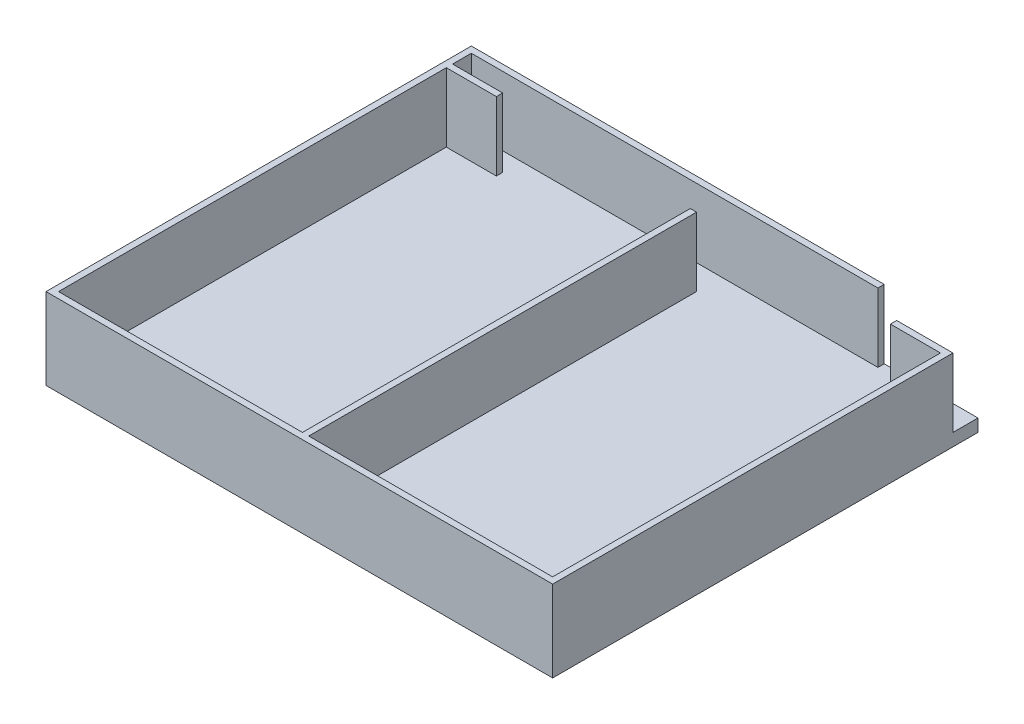
ISO-10303-21;
HEADER;
FILE_DESCRIPTION(('STEP AP214'),'2;1');
FILE_NAME('part.step','',(''),(''),'','','');
FILE_SCHEMA(('AUTOMOTIVE_DESIGN { 1 0 10303 214 1 1 1 1 }'));
ENDSEC;
DATA;
#1=APPLICATION_CONTEXT('core data for automotive mechanical design processes');
#2=APPLICATION_PROTOCOL_DEFINITION('international standard','automotive_design',2000,#1);
#3=PRODUCT_CONTEXT('',#1,'mechanical');
#4=PRODUCT('Part','Part','',(#3));
#5=PRODUCT_RELATED_PRODUCT_CATEGORY('part','',(#4));
#6=PRODUCT_DEFINITION_FORMATION('','',#4);
#7=PRODUCT_DEFINITION_CONTEXT('part definition',#1,'design');
#8=PRODUCT_DEFINITION('design','',#6,#7);
#9=PRODUCT_DEFINITION_SHAPE('','',#8);
#10=(LENGTH_UNIT() NAMED_UNIT(*) SI_UNIT(.MILLI.,.METRE.));
#11=(NAMED_UNIT(*) PLANE_ANGLE_UNIT() SI_UNIT($,.RADIAN.));
#12=(NAMED_UNIT(*) SI_UNIT($,.STERADIAN.) SOLID_ANGLE_UNIT());
#13=UNCERTAINTY_MEASURE_WITH_UNIT(LENGTH_MEASURE(1.E-05),#10,'distance_accuracy_value','');
#14=(GEOMETRIC_REPRESENTATION_CONTEXT(3) GLOBAL_UNCERTAINTY_ASSIGNED_CONTEXT((#13)) GLOBAL_UNIT_ASSIGNED_CONTEXT((#10,
#11,#12)) REPRESENTATION_CONTEXT('',''));
#15=CARTESIAN_POINT('',(0.,0.,0.));
#16=DIRECTION('',(0.,0.,1.));
#17=DIRECTION('',(1.,0.,0.));
#18=AXIS2_PLACEMENT_3D('',#15,#16,#17);
#19=CARTESIAN_POINT('',(0.,0.,0.));
#20=DIRECTION('',(0.,1.,0.));
#21=DIRECTION('',(0.,0.,1.));
#22=AXIS2_PLACEMENT_3D('',#19,#20,#21);
#23=PLANE('',#22);
#24=DIRECTION('',(0.,0.,-1.));
#25=VECTOR('',#24,1.);
#26=CARTESIAN_POINT('',(31.5,0.,0.));
#27=LINE('',#26,#25);
#28=CARTESIAN_POINT('',(31.5,0.,-29.));
#29=VERTEX_POINT('',#28);
#30=CARTESIAN_POINT('',(31.5,0.,-30.));
#31=VERTEX_POINT('',#30);
#32=EDGE_CURVE('E209',#29,#31,#27,.T.);
#33=ORIENTED_EDGE('',*,*,#32,.T.);
#34=DIRECTION('',(1.,0.,0.));
#35=VECTOR('',#34,1.);
#36=CARTESIAN_POINT('',(0.,0.,-30.));
#37=LINE('',#36,#35);
#38=CARTESIAN_POINT('',(40.5,0.,-30.));
#39=VERTEX_POINT('',#38);
#40=EDGE_CURVE('E65',#31,#39,#37,.T.);
#41=ORIENTED_EDGE('',*,*,#40,.T.);
#42=DIRECTION('',(0.,0.,-1.));
#43=VECTOR('',#42,1.);
#44=CARTESIAN_POINT('',(40.5,0.,0.));
#45=LINE('',#44,#43);
#46=CARTESIAN_POINT('',(40.5,0.,-34.));
#47=VERTEX_POINT('',#46);
#48=EDGE_CURVE('E184',#39,#47,#45,.T.);
#49=ORIENTED_EDGE('',*,*,#48,.T.);
#50=DIRECTION('',(1.,0.,0.));
#51=VECTOR('',#50,1.);
#52=CARTESIAN_POINT('',(0.,0.,-34.));
#53=LINE('',#52,#51);
#54=CARTESIAN_POINT('',(25.5,0.,-34.));
#55=VERTEX_POINT('',#54);
#56=EDGE_CURVE('E86',#55,#47,#53,.T.);
#57=ORIENTED_EDGE('',*,*,#56,.F.);
#58=DIRECTION('',(0.,0.,-1.));
#59=VECTOR('',#58,1.);
#60=CARTESIAN_POINT('',(25.5,0.,0.));
#61=LINE('',#60,#59);
#62=CARTESIAN_POINT('',(25.5,0.,-33.));
#63=VERTEX_POINT('',#62);
#64=EDGE_CURVE('E259',#63,#55,#61,.T.);
#65=ORIENTED_EDGE('',*,*,#64,.F.);
#66=DIRECTION('',(1.,0.,0.));
#67=VECTOR('',#66,1.);
#68=CARTESIAN_POINT('',(0.,0.,-33.));
#69=LINE('',#68,#67);
#70=CARTESIAN_POINT('',(-39.5,0.,-33.));
#71=VERTEX_POINT('',#70);
#72=EDGE_CURVE('E256',#71,#63,#69,.T.);
#73=ORIENTED_EDGE('',*,*,#72,.F.);
#74=DIRECTION('',(0.,0.,-1.));
#75=VECTOR('',#74,1.);
#76=CARTESIAN_POINT('',(-39.5000000000003,0.,-3.6544841227245E-13));
#77=LINE('',#76,#75);
#78=CARTESIAN_POINT('',(-39.5,0.,-30.));
#79=VERTEX_POINT('',#78);
#80=EDGE_CURVE('E253',#79,#71,#77,.T.);
#81=ORIENTED_EDGE('',*,*,#80,.F.);
#82=DIRECTION('',(-1.,0.,0.));
#83=VECTOR('',#82,1.);
#84=CARTESIAN_POINT('',(0.,0.,-30.));
#85=LINE('',#84,#83);
#86=CARTESIAN_POINT('',(-31.5,0.,-30.));
#87=VERTEX_POINT('',#86);
#88=EDGE_CURVE('E250',#87,#79,#85,.T.);
#89=ORIENTED_EDGE('',*,*,#88,.F.);
#90=DIRECTION('',(0.,0.,-1.));
#91=VECTOR('',#90,1.);
#92=CARTESIAN_POINT('',(-31.5,0.,0.));
#93=LINE('',#92,#91);
#94=CARTESIAN_POINT('',(-31.5,0.,-29.));
#95=VERTEX_POINT('',#94);
#96=EDGE_CURVE('E247',#95,#87,#93,.T.);
#97=ORIENTED_EDGE('',*,*,#96,.F.);
#98=DIRECTION('',(1.,0.,0.));
#99=VECTOR('',#98,1.);
#100=CARTESIAN_POINT('',(0.,0.,-29.));
#101=LINE('',#100,#99);
#102=CARTESIAN_POINT('',(-39.5,0.,-29.));
#103=VERTEX_POINT('',#102);
#104=EDGE_CURVE('E244',#103,#95,#101,.T.);
#105=ORIENTED_EDGE('',*,*,#104,.F.);
#106=DIRECTION('',(0.,0.,1.));
#107=VECTOR('',#106,1.);
#108=CARTESIAN_POINT('',(-39.5,0.,0.));
#109=LINE('',#108,#107);
#110=CARTESIAN_POINT('',(-39.5,0.,33.));
#111=VERTEX_POINT('',#110);
#112=EDGE_CURVE('E240',#103,#111,#109,.T.);
#113=ORIENTED_EDGE('',*,*,#112,.T.);
#114=DIRECTION('',(1.,0.,0.));
#115=VECTOR('',#114,1.);
#116=CARTESIAN_POINT('',(0.,0.,33.));
#117=LINE('',#116,#115);
#118=CARTESIAN_POINT('',(-0.500000000000008,0.,33.));
#119=VERTEX_POINT('',#118);
#120=EDGE_CURVE('E236',#111,#119,#117,.T.);
#121=ORIENTED_EDGE('',*,*,#120,.T.);
#122=DIRECTION('',(0.,0.,1.));
#123=VECTOR('',#122,1.);
#124=CARTESIAN_POINT('',(-0.500000000000004,0.,0.));
#125=LINE('',#124,#123);
#126=CARTESIAN_POINT('',(-0.5,0.,-29.));
#127=VERTEX_POINT('',#126);
#128=EDGE_CURVE('E232',#127,#119,#125,.T.);
#129=ORIENTED_EDGE('',*,*,#128,.F.);
#130=DIRECTION('',(1.,0.,0.));
#131=VECTOR('',#130,1.);
#132=CARTESIAN_POINT('',(0.,0.,-29.));
#133=LINE('',#132,#131);
#134=CARTESIAN_POINT('',(0.5,0.,-29.));
#135=VERTEX_POINT('',#134);
#136=EDGE_CURVE('E228',#127,#135,#133,.T.);
#137=ORIENTED_EDGE('',*,*,#136,.T.);
#138=DIRECTION('',(0.,0.,1.));
#139=VECTOR('',#138,1.);
#140=CARTESIAN_POINT('',(0.500000000000004,0.,0.));
#141=LINE('',#140,#139);
#142=CARTESIAN_POINT('',(0.500000000000008,0.,33.));
#143=VERTEX_POINT('',#142);
#144=EDGE_CURVE('E224',#135,#143,#141,.T.);
#145=ORIENTED_EDGE('',*,*,#144,.T.);
#146=DIRECTION('',(1.,0.,0.));
#147=VECTOR('',#146,1.);
#148=CARTESIAN_POINT('',(0.,0.,33.));
#149=LINE('',#148,#147);
#150=CARTESIAN_POINT('',(39.5,0.,33.));
#151=VERTEX_POINT('',#150);
#152=EDGE_CURVE('E220',#143,#151,#149,.T.);
#153=ORIENTED_EDGE('',*,*,#152,.T.);
#154=DIRECTION('',(0.,0.,1.));
#155=VECTOR('',#154,1.);
#156=CARTESIAN_POINT('',(39.5,0.,0.));
#157=LINE('',#156,#155);
#158=CARTESIAN_POINT('',(39.5,0.,-29.));
#159=VERTEX_POINT('',#158);
#160=EDGE_CURVE('E216',#159,#151,#157,.T.);
#161=ORIENTED_EDGE('',*,*,#160,.F.);
#162=DIRECTION('',(1.,0.,0.));
#163=VECTOR('',#162,1.);
#164=CARTESIAN_POINT('',(0.,0.,-29.));
#165=LINE('',#164,#163);
#166=EDGE_CURVE('E213',#29,#159,#165,.T.);
#167=ORIENTED_EDGE('',*,*,#166,.F.);
#168=EDGE_LOOP('',(#33,#41,#49,#57,#65,#73,#81,#89,#97,#105,#113,#121,#129,#137,#145,#153,#161,#167));
#169=FACE_BOUND('',#168,.T.);
#170=ADVANCED_FACE('F47',(#169),#23,.T.);
#171=CARTESIAN_POINT('',(40.5,-2.,0.));
#172=DIRECTION('',(1.,0.,0.));
#173=DIRECTION('',(0.,0.,-1.));
#174=AXIS2_PLACEMENT_3D('',#171,#172,#173);
#175=PLANE('',#174);
#176=ORIENTED_EDGE('',*,*,#48,.F.);
#177=DIRECTION('',(0.,-1.,0.));
#178=VECTOR('',#177,1.);
#179=CARTESIAN_POINT('',(40.5,11.,-30.));
#180=LINE('',#179,#178);
#181=CARTESIAN_POINT('',(40.5,11.,-30.));
#182=VERTEX_POINT('',#181);
#183=EDGE_CURVE('E203',#182,#39,#180,.T.);
#184=ORIENTED_EDGE('',*,*,#183,.F.);
#185=DIRECTION('',(0.,0.,-1.));
#186=VECTOR('',#185,1.);
#187=CARTESIAN_POINT('',(40.5,11.,0.));
#188=LINE('',#187,#186);
#189=CARTESIAN_POINT('',(40.5,11.,34.));
#190=VERTEX_POINT('',#189);
#191=EDGE_CURVE('E96',#190,#182,#188,.T.);
#192=ORIENTED_EDGE('',*,*,#191,.F.);
#193=DIRECTION('',(0.,1.,0.));
#194=VECTOR('',#193,1.);
#195=CARTESIAN_POINT('',(40.5,-2.,34.));
#196=LINE('',#195,#194);
#197=CARTESIAN_POINT('',(40.5,-2.,34.));
#198=VERTEX_POINT('',#197);
#199=EDGE_CURVE('E11',#198,#190,#196,.T.);
#200=ORIENTED_EDGE('',*,*,#199,.F.);
#201=DIRECTION('',(0.,0.,-1.));
#202=VECTOR('',#201,1.);
#203=CARTESIAN_POINT('',(40.5,-2.,0.));
#204=LINE('',#203,#202);
#205=CARTESIAN_POINT('',(40.5,-2.,-34.));
#206=VERTEX_POINT('',#205);
#207=EDGE_CURVE('E176',#198,#206,#204,.T.);
#208=ORIENTED_EDGE('',*,*,#207,.T.);
#209=DIRECTION('',(0.,1.,0.));
#210=VECTOR('',#209,1.);
#211=CARTESIAN_POINT('',(40.5,-2.,-34.));
#212=LINE('',#211,#210);
#213=EDGE_CURVE('E51',#206,#47,#212,.T.);
#214=ORIENTED_EDGE('',*,*,#213,.T.);
#215=EDGE_LOOP('',(#176,#184,#192,#200,#208,#214));
#216=FACE_BOUND('',#215,.T.);
#217=ADVANCED_FACE('F49',(#216),#175,.T.);
#218=CARTESIAN_POINT('',(0.,-2.,34.));
#219=DIRECTION('',(0.,0.,-1.));
#220=DIRECTION('',(-1.,0.,0.));
#221=AXIS2_PLACEMENT_3D('',#218,#219,#220);
#222=PLANE('',#221);
#223=ORIENTED_EDGE('',*,*,#199,.T.);
#224=DIRECTION('',(-1.,0.,0.));
#225=VECTOR('',#224,1.);
#226=CARTESIAN_POINT('',(0.,11.,34.));
#227=LINE('',#226,#225);
#228=CARTESIAN_POINT('',(-40.5,11.,34.));
#229=VERTEX_POINT('',#228);
#230=EDGE_CURVE('E194',#190,#229,#227,.T.);
#231=ORIENTED_EDGE('',*,*,#230,.T.);
#232=DIRECTION('',(0.,1.,0.));
#233=VECTOR('',#232,1.);
#234=CARTESIAN_POINT('',(-40.5,-2.,34.));
#235=LINE('',#234,#233);
#236=CARTESIAN_POINT('',(-40.5,-2.,34.));
#237=VERTEX_POINT('',#236);
#238=EDGE_CURVE('E57',#237,#229,#235,.T.);
#239=ORIENTED_EDGE('',*,*,#238,.F.);
#240=DIRECTION('',(-1.,0.,0.));
#241=VECTOR('',#240,1.);
#242=CARTESIAN_POINT('',(0.,-2.,34.));
#243=LINE('',#242,#241);
#244=EDGE_CURVE('E157',#198,#237,#243,.T.);
#245=ORIENTED_EDGE('',*,*,#244,.F.);
#246=EDGE_LOOP('',(#223,#231,#239,#245));
#247=FACE_BOUND('',#246,.T.);
#248=ADVANCED_FACE('F199',(#247),#222,.F.);
#249=CARTESIAN_POINT('',(-40.5,-2.,0.));
#250=DIRECTION('',(1.,0.,0.));
#251=DIRECTION('',(0.,0.,-1.));
#252=AXIS2_PLACEMENT_3D('',#249,#250,#251);
#253=PLANE('',#252);
#254=ORIENTED_EDGE('',*,*,#238,.T.);
#255=DIRECTION('',(0.,0.,-1.));
#256=VECTOR('',#255,1.);
#257=CARTESIAN_POINT('',(-40.5,11.,0.));
#258=LINE('',#257,#256);
#259=CARTESIAN_POINT('',(-40.5,11.,-34.));
#260=VERTEX_POINT('',#259);
#261=EDGE_CURVE('E169',#229,#260,#258,.T.);
#262=ORIENTED_EDGE('',*,*,#261,.T.);
#263=DIRECTION('',(0.,1.,0.));
#264=VECTOR('',#263,1.);
#265=CARTESIAN_POINT('',(-40.5,-2.,-34.));
#266=LINE('',#265,#264);
#267=CARTESIAN_POINT('',(-40.5,-2.,-34.));
#268=VERTEX_POINT('',#267);
#269=EDGE_CURVE('E165',#268,#260,#266,.T.);
#270=ORIENTED_EDGE('',*,*,#269,.F.);
#271=DIRECTION('',(0.,0.,-1.));
#272=VECTOR('',#271,1.);
#273=CARTESIAN_POINT('',(-40.5,-2.,0.));
#274=LINE('',#273,#272);
#275=EDGE_CURVE('E151',#237,#268,#274,.T.);
#276=ORIENTED_EDGE('',*,*,#275,.F.);
#277=EDGE_LOOP('',(#254,#262,#270,#276));
#278=FACE_BOUND('',#277,.T.);
#279=ADVANCED_FACE('F166',(#278),#253,.F.);
#280=CARTESIAN_POINT('',(0.,-2.,-34.));
#281=DIRECTION('',(0.,0.,1.));
#282=DIRECTION('',(1.,0.,0.));
#283=AXIS2_PLACEMENT_3D('',#280,#281,#282);
#284=PLANE('',#283);
#285=ORIENTED_EDGE('',*,*,#269,.T.);
#286=DIRECTION('',(1.,0.,0.));
#287=VECTOR('',#286,1.);
#288=CARTESIAN_POINT('',(0.,11.,-34.));
#289=LINE('',#288,#287);
#290=CARTESIAN_POINT('',(25.5,11.,-34.));
#291=VERTEX_POINT('',#290);
#292=EDGE_CURVE('E196',#260,#291,#289,.T.);
#293=ORIENTED_EDGE('',*,*,#292,.T.);
#294=DIRECTION('',(0.,-1.,0.));
#295=VECTOR('',#294,1.);
#296=CARTESIAN_POINT('',(25.5,11.,-34.));
#297=LINE('',#296,#295);
#298=EDGE_CURVE('E266',#291,#55,#297,.T.);
#299=ORIENTED_EDGE('',*,*,#298,.T.);
#300=ORIENTED_EDGE('',*,*,#56,.T.);
#301=ORIENTED_EDGE('',*,*,#213,.F.);
#302=DIRECTION('',(1.,0.,0.));
#303=VECTOR('',#302,1.);
#304=CARTESIAN_POINT('',(0.,-2.,-34.));
#305=LINE('',#304,#303);
#306=EDGE_CURVE('E156',#268,#206,#305,.T.);
#307=ORIENTED_EDGE('',*,*,#306,.F.);
#308=EDGE_LOOP('',(#285,#293,#299,#300,#301,#307));
#309=FACE_BOUND('',#308,.T.);
#310=ADVANCED_FACE('F173',(#309),#284,.F.);
#311=CARTESIAN_POINT('',(0.,-2.,0.));
#312=DIRECTION('',(0.,1.,0.));
#313=DIRECTION('',(0.,0.,1.));
#314=AXIS2_PLACEMENT_3D('',#311,#312,#313);
#315=PLANE('',#314);
#316=ORIENTED_EDGE('',*,*,#207,.F.);
#317=ORIENTED_EDGE('',*,*,#244,.T.);
#318=ORIENTED_EDGE('',*,*,#275,.T.);
#319=ORIENTED_EDGE('',*,*,#306,.T.);
#320=EDGE_LOOP('',(#316,#317,#318,#319));
#321=FACE_BOUND('',#320,.T.);
#322=ADVANCED_FACE('F154',(#321),#315,.F.);
#323=CARTESIAN_POINT('',(0.,11.,-30.));
#324=DIRECTION('',(0.,0.,-1.));
#325=DIRECTION('',(-1.,0.,0.));
#326=AXIS2_PLACEMENT_3D('',#323,#324,#325);
#327=PLANE('',#326);
#328=ORIENTED_EDGE('',*,*,#40,.F.);
#329=DIRECTION('',(0.,-1.,0.));
#330=VECTOR('',#329,1.);
#331=CARTESIAN_POINT('',(31.5,11.,-30.));
#332=LINE('',#331,#330);
#333=CARTESIAN_POINT('',(31.5,11.,-30.));
#334=VERTEX_POINT('',#333);
#335=EDGE_CURVE('E187',#334,#31,#332,.T.);
#336=ORIENTED_EDGE('',*,*,#335,.F.);
#337=DIRECTION('',(1.,0.,0.));
#338=VECTOR('',#337,1.);
#339=CARTESIAN_POINT('',(0.,11.,-30.));
#340=LINE('',#339,#338);
#341=EDGE_CURVE('E263',#334,#182,#340,.T.);
#342=ORIENTED_EDGE('',*,*,#341,.T.);
#343=ORIENTED_EDGE('',*,*,#183,.T.);
#344=EDGE_LOOP('',(#328,#336,#342,#343));
#345=FACE_BOUND('',#344,.T.);
#346=ADVANCED_FACE('F439',(#345),#327,.T.);
#347=CARTESIAN_POINT('',(31.5,11.,0.));
#348=DIRECTION('',(-1.,0.,0.));
#349=DIRECTION('',(0.,0.,1.));
#350=AXIS2_PLACEMENT_3D('',#347,#348,#349);
#351=PLANE('',#350);
#352=ORIENTED_EDGE('',*,*,#32,.F.);
#353=DIRECTION('',(0.,-1.,0.));
#354=VECTOR('',#353,1.);
#355=CARTESIAN_POINT('',(31.5,11.,-29.));
#356=LINE('',#355,#354);
#357=CARTESIAN_POINT('',(31.5,11.,-29.));
#358=VERTEX_POINT('',#357);
#359=EDGE_CURVE('E314',#358,#29,#356,.T.);
#360=ORIENTED_EDGE('',*,*,#359,.F.);
#361=DIRECTION('',(0.,0.,-1.));
#362=VECTOR('',#361,1.);
#363=CARTESIAN_POINT('',(31.5,11.,0.));
#364=LINE('',#363,#362);
#365=EDGE_CURVE('E324',#358,#334,#364,.T.);
#366=ORIENTED_EDGE('',*,*,#365,.T.);
#367=ORIENTED_EDGE('',*,*,#335,.T.);
#368=EDGE_LOOP('',(#352,#360,#366,#367));
#369=FACE_BOUND('',#368,.T.);
#370=ADVANCED_FACE('F320',(#369),#351,.T.);
#371=CARTESIAN_POINT('',(0.,11.,-29.));
#372=DIRECTION('',(0.,0.,-1.));
#373=DIRECTION('',(-1.,0.,0.));
#374=AXIS2_PLACEMENT_3D('',#371,#372,#373);
#375=PLANE('',#374);
#376=ORIENTED_EDGE('',*,*,#166,.T.);
#377=DIRECTION('',(0.,-1.,0.));
#378=VECTOR('',#377,1.);
#379=CARTESIAN_POINT('',(39.5,11.,-29.));
#380=LINE('',#379,#378);
#381=CARTESIAN_POINT('',(39.5,11.,-29.));
#382=VERTEX_POINT('',#381);
#383=EDGE_CURVE('E310',#382,#159,#380,.T.);
#384=ORIENTED_EDGE('',*,*,#383,.F.);
#385=DIRECTION('',(1.,0.,0.));
#386=VECTOR('',#385,1.);
#387=CARTESIAN_POINT('',(0.,11.,-29.));
#388=LINE('',#387,#386);
#389=EDGE_CURVE('E348',#358,#382,#388,.T.);
#390=ORIENTED_EDGE('',*,*,#389,.F.);
#391=ORIENTED_EDGE('',*,*,#359,.T.);
#392=EDGE_LOOP('',(#376,#384,#390,#391));
#393=FACE_BOUND('',#392,.T.);
#394=ADVANCED_FACE('F331',(#393),#375,.F.);
#395=CARTESIAN_POINT('',(39.5,11.,0.));
#396=DIRECTION('',(1.,0.,0.));
#397=DIRECTION('',(0.,0.,-1.));
#398=AXIS2_PLACEMENT_3D('',#395,#396,#397);
#399=PLANE('',#398);
#400=ORIENTED_EDGE('',*,*,#160,.T.);
#401=DIRECTION('',(0.,-1.,0.));
#402=VECTOR('',#401,1.);
#403=CARTESIAN_POINT('',(39.5,11.,33.));
#404=LINE('',#403,#402);
#405=CARTESIAN_POINT('',(39.5,11.,33.));
#406=VERTEX_POINT('',#405);
#407=EDGE_CURVE('E307',#406,#151,#404,.T.);
#408=ORIENTED_EDGE('',*,*,#407,.F.);
#409=DIRECTION('',(0.,0.,1.));
#410=VECTOR('',#409,1.);
#411=CARTESIAN_POINT('',(39.5,11.,0.));
#412=LINE('',#411,#410);
#413=EDGE_CURVE('E339',#382,#406,#412,.T.);
#414=ORIENTED_EDGE('',*,*,#413,.F.);
#415=ORIENTED_EDGE('',*,*,#383,.T.);
#416=EDGE_LOOP('',(#400,#408,#414,#415));
#417=FACE_BOUND('',#416,.T.);
#418=ADVANCED_FACE('F336',(#417),#399,.F.);
#419=CARTESIAN_POINT('',(0.,11.,33.));
#420=DIRECTION('',(0.,0.,-1.));
#421=DIRECTION('',(-1.,0.,0.));
#422=AXIS2_PLACEMENT_3D('',#419,#420,#421);
#423=PLANE('',#422);
#424=ORIENTED_EDGE('',*,*,#152,.F.);
#425=DIRECTION('',(0.,-1.,0.));
#426=VECTOR('',#425,1.);
#427=CARTESIAN_POINT('',(0.500000000000008,11.,33.));
#428=LINE('',#427,#426);
#429=CARTESIAN_POINT('',(0.500000000000008,11.,33.));
#430=VERTEX_POINT('',#429);
#431=EDGE_CURVE('E304',#430,#143,#428,.T.);
#432=ORIENTED_EDGE('',*,*,#431,.F.);
#433=DIRECTION('',(1.,0.,0.));
#434=VECTOR('',#433,1.);
#435=CARTESIAN_POINT('',(0.,11.,33.));
#436=LINE('',#435,#434);
#437=EDGE_CURVE('E347',#430,#406,#436,.T.);
#438=ORIENTED_EDGE('',*,*,#437,.T.);
#439=ORIENTED_EDGE('',*,*,#407,.T.);
#440=EDGE_LOOP('',(#424,#432,#438,#439));
#441=FACE_BOUND('',#440,.T.);
#442=ADVANCED_FACE('F491',(#441),#423,.T.);
#443=CARTESIAN_POINT('',(0.500000000000004,11.,0.));
#444=DIRECTION('',(1.,0.,0.));
#445=DIRECTION('',(0.,0.,-1.));
#446=AXIS2_PLACEMENT_3D('',#443,#444,#445);
#447=PLANE('',#446);
#448=ORIENTED_EDGE('',*,*,#144,.F.);
#449=DIRECTION('',(0.,-1.,0.));
#450=VECTOR('',#449,1.);
#451=CARTESIAN_POINT('',(0.5,11.,-29.));
#452=LINE('',#451,#450);
#453=CARTESIAN_POINT('',(0.5,11.,-29.));
#454=VERTEX_POINT('',#453);
#455=EDGE_CURVE('E301',#454,#135,#452,.T.);
#456=ORIENTED_EDGE('',*,*,#455,.F.);
#457=DIRECTION('',(0.,0.,1.));
#458=VECTOR('',#457,1.);
#459=CARTESIAN_POINT('',(0.500000000000004,11.,0.));
#460=LINE('',#459,#458);
#461=EDGE_CURVE('E352',#454,#430,#460,.T.);
#462=ORIENTED_EDGE('',*,*,#461,.T.);
#463=ORIENTED_EDGE('',*,*,#431,.T.);
#464=EDGE_LOOP('',(#448,#456,#462,#463));
#465=FACE_BOUND('',#464,.T.);
#466=ADVANCED_FACE('F488',(#465),#447,.T.);
#467=CARTESIAN_POINT('',(0.,11.,-29.));
#468=DIRECTION('',(0.,0.,-1.));
#469=DIRECTION('',(-1.,0.,0.));
#470=AXIS2_PLACEMENT_3D('',#467,#468,#469);
#471=PLANE('',#470);
#472=ORIENTED_EDGE('',*,*,#136,.F.);
#473=DIRECTION('',(0.,-1.,0.));
#474=VECTOR('',#473,1.);
#475=CARTESIAN_POINT('',(-0.5,11.,-29.));
#476=LINE('',#475,#474);
#477=CARTESIAN_POINT('',(-0.5,11.,-29.));
#478=VERTEX_POINT('',#477);
#479=EDGE_CURVE('E298',#478,#127,#476,.T.);
#480=ORIENTED_EDGE('',*,*,#479,.F.);
#481=DIRECTION('',(1.,0.,0.));
#482=VECTOR('',#481,1.);
#483=CARTESIAN_POINT('',(0.,11.,-29.));
#484=LINE('',#483,#482);
#485=EDGE_CURVE('E360',#478,#454,#484,.T.);
#486=ORIENTED_EDGE('',*,*,#485,.T.);
#487=ORIENTED_EDGE('',*,*,#455,.T.);
#488=EDGE_LOOP('',(#472,#480,#486,#487));
#489=FACE_BOUND('',#488,.T.);
#490=ADVANCED_FACE('F484',(#489),#471,.T.);
#491=CARTESIAN_POINT('',(-0.500000000000004,11.,0.));
#492=DIRECTION('',(1.,0.,0.));
#493=DIRECTION('',(0.,0.,-1.));
#494=AXIS2_PLACEMENT_3D('',#491,#492,#493);
#495=PLANE('',#494);
#496=ORIENTED_EDGE('',*,*,#128,.T.);
#497=DIRECTION('',(0.,-1.,0.));
#498=VECTOR('',#497,1.);
#499=CARTESIAN_POINT('',(-0.500000000000008,11.,33.));
#500=LINE('',#499,#498);
#501=CARTESIAN_POINT('',(-0.500000000000008,11.,33.));
#502=VERTEX_POINT('',#501);
#503=EDGE_CURVE('E295',#502,#119,#500,.T.);
#504=ORIENTED_EDGE('',*,*,#503,.F.);
#505=DIRECTION('',(0.,0.,1.));
#506=VECTOR('',#505,1.);
#507=CARTESIAN_POINT('',(-0.500000000000004,11.,0.));
#508=LINE('',#507,#506);
#509=EDGE_CURVE('E364',#478,#502,#508,.T.);
#510=ORIENTED_EDGE('',*,*,#509,.F.);
#511=ORIENTED_EDGE('',*,*,#479,.T.);
#512=EDGE_LOOP('',(#496,#504,#510,#511));
#513=FACE_BOUND('',#512,.T.);
#514=ADVANCED_FACE('F480',(#513),#495,.F.);
#515=CARTESIAN_POINT('',(0.,11.,33.));
#516=DIRECTION('',(0.,0.,-1.));
#517=DIRECTION('',(-1.,0.,0.));
#518=AXIS2_PLACEMENT_3D('',#515,#516,#517);
#519=PLANE('',#518);
#520=ORIENTED_EDGE('',*,*,#120,.F.);
#521=DIRECTION('',(0.,-1.,0.));
#522=VECTOR('',#521,1.);
#523=CARTESIAN_POINT('',(-39.5,11.,33.));
#524=LINE('',#523,#522);
#525=CARTESIAN_POINT('',(-39.5,11.,33.));
#526=VERTEX_POINT('',#525);
#527=EDGE_CURVE('E292',#526,#111,#524,.T.);
#528=ORIENTED_EDGE('',*,*,#527,.F.);
#529=DIRECTION('',(1.,0.,0.));
#530=VECTOR('',#529,1.);
#531=CARTESIAN_POINT('',(0.,11.,33.));
#532=LINE('',#531,#530);
#533=EDGE_CURVE('E368',#526,#502,#532,.T.);
#534=ORIENTED_EDGE('',*,*,#533,.T.);
#535=ORIENTED_EDGE('',*,*,#503,.T.);
#536=EDGE_LOOP('',(#520,#528,#534,#535));
#537=FACE_BOUND('',#536,.T.);
#538=ADVANCED_FACE('F476',(#537),#519,.T.);
#539=CARTESIAN_POINT('',(-39.5,11.,0.));
#540=DIRECTION('',(1.,0.,0.));
#541=DIRECTION('',(0.,0.,-1.));
#542=AXIS2_PLACEMENT_3D('',#539,#540,#541);
#543=PLANE('',#542);
#544=ORIENTED_EDGE('',*,*,#112,.F.);
#545=DIRECTION('',(0.,-1.,0.));
#546=VECTOR('',#545,1.);
#547=CARTESIAN_POINT('',(-39.5,11.,-29.));
#548=LINE('',#547,#546);
#549=CARTESIAN_POINT('',(-39.5,11.,-29.));
#550=VERTEX_POINT('',#549);
#551=EDGE_CURVE('E289',#550,#103,#548,.T.);
#552=ORIENTED_EDGE('',*,*,#551,.F.);
#553=DIRECTION('',(0.,0.,1.));
#554=VECTOR('',#553,1.);
#555=CARTESIAN_POINT('',(-39.5,11.,0.));
#556=LINE('',#555,#554);
#557=EDGE_CURVE('E372',#550,#526,#556,.T.);
#558=ORIENTED_EDGE('',*,*,#557,.T.);
#559=ORIENTED_EDGE('',*,*,#527,.T.);
#560=EDGE_LOOP('',(#544,#552,#558,#559));
#561=FACE_BOUND('',#560,.T.);
#562=ADVANCED_FACE('F473',(#561),#543,.T.);
#563=CARTESIAN_POINT('',(0.,11.,-29.));
#564=DIRECTION('',(0.,0.,-1.));
#565=DIRECTION('',(-1.,0.,0.));
#566=AXIS2_PLACEMENT_3D('',#563,#564,#565);
#567=PLANE('',#566);
#568=ORIENTED_EDGE('',*,*,#104,.T.);
#569=DIRECTION('',(0.,-1.,0.));
#570=VECTOR('',#569,1.);
#571=CARTESIAN_POINT('',(-31.5,11.,-29.));
#572=LINE('',#571,#570);
#573=CARTESIAN_POINT('',(-31.5,11.,-29.));
#574=VERTEX_POINT('',#573);
#575=EDGE_CURVE('E285',#574,#95,#572,.T.);
#576=ORIENTED_EDGE('',*,*,#575,.F.);
#577=DIRECTION('',(1.,0.,0.));
#578=VECTOR('',#577,1.);
#579=CARTESIAN_POINT('',(0.,11.,-29.));
#580=LINE('',#579,#578);
#581=EDGE_CURVE('E376',#550,#574,#580,.T.);
#582=ORIENTED_EDGE('',*,*,#581,.F.);
#583=ORIENTED_EDGE('',*,*,#551,.T.);
#584=EDGE_LOOP('',(#568,#576,#582,#583));
#585=FACE_BOUND('',#584,.T.);
#586=ADVANCED_FACE('F467',(#585),#567,.F.);
#587=CARTESIAN_POINT('',(-31.5,11.,0.));
#588=DIRECTION('',(-1.,0.,0.));
#589=DIRECTION('',(0.,0.,1.));
#590=AXIS2_PLACEMENT_3D('',#587,#588,#589);
#591=PLANE('',#590);
#592=ORIENTED_EDGE('',*,*,#96,.T.);
#593=DIRECTION('',(0.,-1.,0.));
#594=VECTOR('',#593,1.);
#595=CARTESIAN_POINT('',(-31.5,11.,-30.));
#596=LINE('',#595,#594);
#597=CARTESIAN_POINT('',(-31.5,11.,-30.));
#598=VERTEX_POINT('',#597);
#599=EDGE_CURVE('E281',#598,#87,#596,.T.);
#600=ORIENTED_EDGE('',*,*,#599,.F.);
#601=DIRECTION('',(0.,0.,-1.));
#602=VECTOR('',#601,1.);
#603=CARTESIAN_POINT('',(-31.5,11.,0.));
#604=LINE('',#603,#602);
#605=EDGE_CURVE('E380',#574,#598,#604,.T.);
#606=ORIENTED_EDGE('',*,*,#605,.F.);
#607=ORIENTED_EDGE('',*,*,#575,.T.);
#608=EDGE_LOOP('',(#592,#600,#606,#607));
#609=FACE_BOUND('',#608,.T.);
#610=ADVANCED_FACE('F463',(#609),#591,.F.);
#611=CARTESIAN_POINT('',(0.,11.,-30.));
#612=DIRECTION('',(0.,0.,1.));
#613=DIRECTION('',(1.,0.,0.));
#614=AXIS2_PLACEMENT_3D('',#611,#612,#613);
#615=PLANE('',#614);
#616=ORIENTED_EDGE('',*,*,#88,.T.);
#617=DIRECTION('',(0.,-1.,0.));
#618=VECTOR('',#617,1.);
#619=CARTESIAN_POINT('',(-39.5,11.,-30.));
#620=LINE('',#619,#618);
#621=CARTESIAN_POINT('',(-39.5,11.,-30.));
#622=VERTEX_POINT('',#621);
#623=EDGE_CURVE('E277',#622,#79,#620,.T.);
#624=ORIENTED_EDGE('',*,*,#623,.F.);
#625=DIRECTION('',(-1.,0.,0.));
#626=VECTOR('',#625,1.);
#627=CARTESIAN_POINT('',(0.,11.,-30.));
#628=LINE('',#627,#626);
#629=EDGE_CURVE('E384',#598,#622,#628,.T.);
#630=ORIENTED_EDGE('',*,*,#629,.F.);
#631=ORIENTED_EDGE('',*,*,#599,.T.);
#632=EDGE_LOOP('',(#616,#624,#630,#631));
#633=FACE_BOUND('',#632,.T.);
#634=ADVANCED_FACE('F458',(#633),#615,.F.);
#635=CARTESIAN_POINT('',(-39.5000000000003,11.,-3.6544841227245E-13));
#636=DIRECTION('',(-1.,0.,0.));
#637=DIRECTION('',(0.,0.,1.));
#638=AXIS2_PLACEMENT_3D('',#635,#636,#637);
#639=PLANE('',#638);
#640=ORIENTED_EDGE('',*,*,#80,.T.);
#641=DIRECTION('',(0.,-1.,0.));
#642=VECTOR('',#641,1.);
#643=CARTESIAN_POINT('',(-39.5,11.,-33.));
#644=LINE('',#643,#642);
#645=CARTESIAN_POINT('',(-39.5,11.,-33.));
#646=VERTEX_POINT('',#645);
#647=EDGE_CURVE('E273',#646,#71,#644,.T.);
#648=ORIENTED_EDGE('',*,*,#647,.F.);
#649=DIRECTION('',(0.,0.,-1.));
#650=VECTOR('',#649,1.);
#651=CARTESIAN_POINT('',(-39.5000000000003,11.,-3.6544841227245E-13));
#652=LINE('',#651,#650);
#653=EDGE_CURVE('E388',#622,#646,#652,.T.);
#654=ORIENTED_EDGE('',*,*,#653,.F.);
#655=ORIENTED_EDGE('',*,*,#623,.T.);
#656=EDGE_LOOP('',(#640,#648,#654,#655));
#657=FACE_BOUND('',#656,.T.);
#658=ADVANCED_FACE('F452',(#657),#639,.F.);
#659=CARTESIAN_POINT('',(0.,11.,-33.));
#660=DIRECTION('',(0.,0.,-1.));
#661=DIRECTION('',(-1.,0.,0.));
#662=AXIS2_PLACEMENT_3D('',#659,#660,#661);
#663=PLANE('',#662);
#664=ORIENTED_EDGE('',*,*,#72,.T.);
#665=DIRECTION('',(0.,-1.,0.));
#666=VECTOR('',#665,1.);
#667=CARTESIAN_POINT('',(25.5,11.,-33.));
#668=LINE('',#667,#666);
#669=CARTESIAN_POINT('',(25.5,11.,-33.));
#670=VERTEX_POINT('',#669);
#671=EDGE_CURVE('E269',#670,#63,#668,.T.);
#672=ORIENTED_EDGE('',*,*,#671,.F.);
#673=DIRECTION('',(1.,0.,0.));
#674=VECTOR('',#673,1.);
#675=CARTESIAN_POINT('',(0.,11.,-33.));
#676=LINE('',#675,#674);
#677=EDGE_CURVE('E392',#646,#670,#676,.T.);
#678=ORIENTED_EDGE('',*,*,#677,.F.);
#679=ORIENTED_EDGE('',*,*,#647,.T.);
#680=EDGE_LOOP('',(#664,#672,#678,#679));
#681=FACE_BOUND('',#680,.T.);
#682=ADVANCED_FACE('F448',(#681),#663,.F.);
#683=CARTESIAN_POINT('',(25.5,11.,0.));
#684=DIRECTION('',(-1.,0.,0.));
#685=DIRECTION('',(0.,0.,1.));
#686=AXIS2_PLACEMENT_3D('',#683,#684,#685);
#687=PLANE('',#686);
#688=ORIENTED_EDGE('',*,*,#64,.T.);
#689=ORIENTED_EDGE('',*,*,#298,.F.);
#690=DIRECTION('',(0.,0.,-1.));
#691=VECTOR('',#690,1.);
#692=CARTESIAN_POINT('',(25.5,11.,0.));
#693=LINE('',#692,#691);
#694=EDGE_CURVE('E396',#670,#291,#693,.T.);
#695=ORIENTED_EDGE('',*,*,#694,.F.);
#696=ORIENTED_EDGE('',*,*,#671,.T.);
#697=EDGE_LOOP('',(#688,#689,#695,#696));
#698=FACE_BOUND('',#697,.T.);
#699=ADVANCED_FACE('F444',(#698),#687,.F.);
#700=CARTESIAN_POINT('',(0.,11.,0.));
#701=DIRECTION('',(0.,1.,0.));
#702=DIRECTION('',(0.,0.,1.));
#703=AXIS2_PLACEMENT_3D('',#700,#701,#702);
#704=PLANE('',#703);
#705=ORIENTED_EDGE('',*,*,#341,.F.);
#706=ORIENTED_EDGE('',*,*,#365,.F.);
#707=ORIENTED_EDGE('',*,*,#389,.T.);
#708=ORIENTED_EDGE('',*,*,#413,.T.);
#709=ORIENTED_EDGE('',*,*,#437,.F.);
#710=ORIENTED_EDGE('',*,*,#461,.F.);
#711=ORIENTED_EDGE('',*,*,#485,.F.);
#712=ORIENTED_EDGE('',*,*,#509,.T.);
#713=ORIENTED_EDGE('',*,*,#533,.F.);
#714=ORIENTED_EDGE('',*,*,#557,.F.);
#715=ORIENTED_EDGE('',*,*,#581,.T.);
#716=ORIENTED_EDGE('',*,*,#605,.T.);
#717=ORIENTED_EDGE('',*,*,#629,.T.);
#718=ORIENTED_EDGE('',*,*,#653,.T.);
#719=ORIENTED_EDGE('',*,*,#677,.T.);
#720=ORIENTED_EDGE('',*,*,#694,.T.);
#721=ORIENTED_EDGE('',*,*,#292,.F.);
#722=ORIENTED_EDGE('',*,*,#261,.F.);
#723=ORIENTED_EDGE('',*,*,#230,.F.);
#724=ORIENTED_EDGE('',*,*,#191,.T.);
#725=EDGE_LOOP('',(#705,#706,#707,#708,#709,#710,#711,#712,#713,#714,#715,#716,#717,#718,#719,
#720,#721,#722,#723,#724));
#726=FACE_BOUND('',#725,.T.);
#727=ADVANCED_FACE('F193',(#726),#704,.T.);
#728=CLOSED_SHELL('',(#170,#217,#248,#279,#310,#322,#346,#370,#394,#418,#442,#466,#490,#514,
#538,#562,#586,#610,#634,#658,#682,#699,#727));
#729=MANIFOLD_SOLID_BREP('B2',#728);
#730=ADVANCED_BREP_SHAPE_REPRESENTATION('',(#18,#729),#14);
#731=SHAPE_DEFINITION_REPRESENTATION(#9,#730);
ENDSEC;
END-ISO-10303-21;
